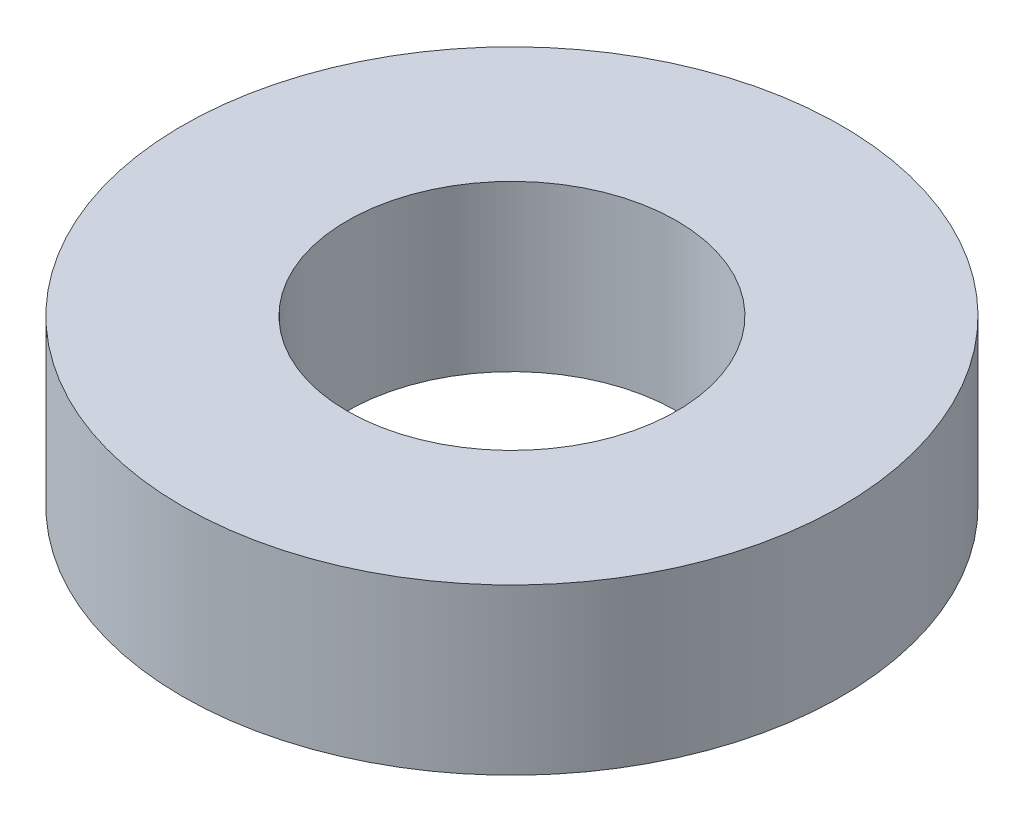
ISO-10303-21;
HEADER;
FILE_DESCRIPTION(('STEP AP214'),'2;1');
FILE_NAME('part.step','',(''),(''),'','','');
FILE_SCHEMA(('AUTOMOTIVE_DESIGN { 1 0 10303 214 1 1 1 1 }'));
ENDSEC;
DATA;
#1=APPLICATION_CONTEXT('core data for automotive mechanical design processes');
#2=APPLICATION_PROTOCOL_DEFINITION('international standard','automotive_design',2000,#1);
#3=PRODUCT_CONTEXT('',#1,'mechanical');
#4=PRODUCT('Part','Part','',(#3));
#5=PRODUCT_RELATED_PRODUCT_CATEGORY('part','',(#4));
#6=PRODUCT_DEFINITION_FORMATION('','',#4);
#7=PRODUCT_DEFINITION_CONTEXT('part definition',#1,'design');
#8=PRODUCT_DEFINITION('design','',#6,#7);
#9=PRODUCT_DEFINITION_SHAPE('','',#8);
#10=(LENGTH_UNIT() NAMED_UNIT(*) SI_UNIT(.MILLI.,.METRE.));
#11=(NAMED_UNIT(*) PLANE_ANGLE_UNIT() SI_UNIT($,.RADIAN.));
#12=(NAMED_UNIT(*) SI_UNIT($,.STERADIAN.) SOLID_ANGLE_UNIT());
#13=UNCERTAINTY_MEASURE_WITH_UNIT(LENGTH_MEASURE(1.E-05),#10,'distance_accuracy_value','');
#14=(GEOMETRIC_REPRESENTATION_CONTEXT(3) GLOBAL_UNCERTAINTY_ASSIGNED_CONTEXT((#13)) GLOBAL_UNIT_ASSIGNED_CONTEXT((#10,
#11,#12)) REPRESENTATION_CONTEXT('',''));
#15=CARTESIAN_POINT('',(0.,0.,0.));
#16=DIRECTION('',(0.,0.,1.));
#17=DIRECTION('',(1.,0.,0.));
#18=AXIS2_PLACEMENT_3D('',#15,#16,#17);
#19=CARTESIAN_POINT('',(0.,20.,0.));
#20=DIRECTION('',(0.,1.,0.));
#21=DIRECTION('',(0.,0.,1.));
#22=AXIS2_PLACEMENT_3D('',#19,#20,#21);
#23=PLANE('',#22);
#24=CARTESIAN_POINT('',(0.,20.,0.));
#25=DIRECTION('',(0.,1.,0.));
#26=DIRECTION('',(0.,0.,1.));
#27=AXIS2_PLACEMENT_3D('',#24,#25,#26);
#28=CIRCLE('',#27,40.);
#29=CARTESIAN_POINT('',(0.,20.,40.));
#30=VERTEX_POINT('',#29);
#31=EDGE_CURVE('E10',#30,#30,#28,.T.);
#32=ORIENTED_EDGE('',*,*,#31,.T.);
#33=EDGE_LOOP('',(#32));
#34=FACE_BOUND('',#33,.T.);
#35=CARTESIAN_POINT('',(0.,20.,0.));
#36=DIRECTION('',(0.,1.,0.));
#37=DIRECTION('',(0.,0.,1.));
#38=AXIS2_PLACEMENT_3D('',#35,#36,#37);
#39=CIRCLE('',#38,20.);
#40=CARTESIAN_POINT('',(0.,20.,20.));
#41=VERTEX_POINT('',#40);
#42=EDGE_CURVE('E43',#41,#41,#39,.T.);
#43=ORIENTED_EDGE('',*,*,#42,.F.);
#44=EDGE_LOOP('',(#43));
#45=FACE_BOUND('',#44,.T.);
#46=ADVANCED_FACE('F32',(#34,#45),#23,.T.);
#47=CARTESIAN_POINT('',(0.,0.,0.));
#48=DIRECTION('',(0.,1.,0.));
#49=DIRECTION('',(0.,0.,1.));
#50=AXIS2_PLACEMENT_3D('',#47,#48,#49);
#51=PLANE('',#50);
#52=CARTESIAN_POINT('',(0.,0.,0.));
#53=DIRECTION('',(0.,1.,0.));
#54=DIRECTION('',(0.,0.,1.));
#55=AXIS2_PLACEMENT_3D('',#52,#53,#54);
#56=CIRCLE('',#55,40.);
#57=CARTESIAN_POINT('',(0.,0.,40.));
#58=VERTEX_POINT('',#57);
#59=EDGE_CURVE('E36',#58,#58,#56,.T.);
#60=ORIENTED_EDGE('',*,*,#59,.F.);
#61=EDGE_LOOP('',(#60));
#62=FACE_BOUND('',#61,.T.);
#63=CARTESIAN_POINT('',(0.,0.,0.));
#64=DIRECTION('',(0.,1.,0.));
#65=DIRECTION('',(0.,0.,1.));
#66=AXIS2_PLACEMENT_3D('',#63,#64,#65);
#67=CIRCLE('',#66,20.);
#68=CARTESIAN_POINT('',(0.,0.,20.));
#69=VERTEX_POINT('',#68);
#70=EDGE_CURVE('E45',#69,#69,#67,.T.);
#71=ORIENTED_EDGE('',*,*,#70,.T.);
#72=EDGE_LOOP('',(#71));
#73=FACE_BOUND('',#72,.T.);
#74=ADVANCED_FACE('F55',(#62,#73),#51,.F.);
#75=CARTESIAN_POINT('',(0.,20.,0.));
#76=DIRECTION('',(0.,-1.,0.));
#77=DIRECTION('',(0.,0.,-1.));
#78=AXIS2_PLACEMENT_3D('',#75,#76,#77);
#79=CYLINDRICAL_SURFACE('',#78,40.);
#80=ORIENTED_EDGE('',*,*,#31,.F.);
#81=EDGE_LOOP('',(#80));
#82=FACE_BOUND('',#81,.T.);
#83=ORIENTED_EDGE('',*,*,#59,.T.);
#84=EDGE_LOOP('',(#83));
#85=FACE_BOUND('',#84,.T.);
#86=ADVANCED_FACE('F34',(#82,#85),#79,.T.);
#87=CARTESIAN_POINT('',(0.,20.,0.));
#88=DIRECTION('',(0.,-1.,0.));
#89=DIRECTION('',(0.,0.,-1.));
#90=AXIS2_PLACEMENT_3D('',#87,#88,#89);
#91=CYLINDRICAL_SURFACE('',#90,20.);
#92=ORIENTED_EDGE('',*,*,#42,.T.);
#93=EDGE_LOOP('',(#92));
#94=FACE_BOUND('',#93,.T.);
#95=ORIENTED_EDGE('',*,*,#70,.F.);
#96=EDGE_LOOP('',(#95));
#97=FACE_BOUND('',#96,.T.);
#98=ADVANCED_FACE('F51',(#94,#97),#91,.F.);
#99=CLOSED_SHELL('',(#46,#74,#86,#98));
#100=MANIFOLD_SOLID_BREP('B2',#99);
#101=ADVANCED_BREP_SHAPE_REPRESENTATION('',(#18,#100),#14);
#102=SHAPE_DEFINITION_REPRESENTATION(#9,#101);
ENDSEC;
END-ISO-10303-21;
